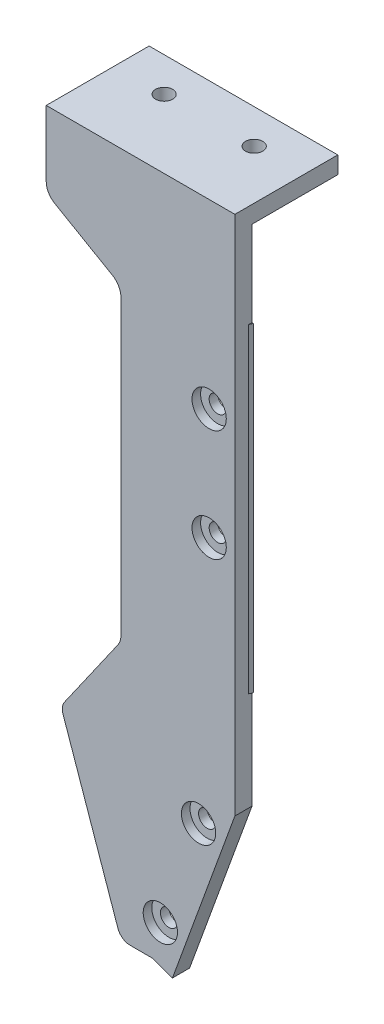
ISO-10303-21;
HEADER;
FILE_DESCRIPTION(('STEP AP214'),'2;1');
FILE_NAME('part.step','',(''),(''),'','','');
FILE_SCHEMA(('AUTOMOTIVE_DESIGN { 1 0 10303 214 1 1 1 1 }'));
ENDSEC;
DATA;
#1=APPLICATION_CONTEXT('core data for automotive mechanical design processes');
#2=APPLICATION_PROTOCOL_DEFINITION('international standard','automotive_design',2000,#1);
#3=PRODUCT_CONTEXT('',#1,'mechanical');
#4=PRODUCT('Part','Part','',(#3));
#5=PRODUCT_RELATED_PRODUCT_CATEGORY('part','',(#4));
#6=PRODUCT_DEFINITION_FORMATION('','',#4);
#7=PRODUCT_DEFINITION_CONTEXT('part definition',#1,'design');
#8=PRODUCT_DEFINITION('design','',#6,#7);
#9=PRODUCT_DEFINITION_SHAPE('','',#8);
#10=(LENGTH_UNIT() NAMED_UNIT(*) SI_UNIT(.MILLI.,.METRE.));
#11=(NAMED_UNIT(*) PLANE_ANGLE_UNIT() SI_UNIT($,.RADIAN.));
#12=(NAMED_UNIT(*) SI_UNIT($,.STERADIAN.) SOLID_ANGLE_UNIT());
#13=UNCERTAINTY_MEASURE_WITH_UNIT(LENGTH_MEASURE(1.E-05),#10,'distance_accuracy_value','');
#14=(GEOMETRIC_REPRESENTATION_CONTEXT(3) GLOBAL_UNCERTAINTY_ASSIGNED_CONTEXT((#13)) GLOBAL_UNIT_ASSIGNED_CONTEXT((#10,
#11,#12)) REPRESENTATION_CONTEXT('',''));
#15=CARTESIAN_POINT('',(0.,0.,0.));
#16=DIRECTION('',(0.,0.,1.));
#17=DIRECTION('',(1.,0.,0.));
#18=AXIS2_PLACEMENT_3D('',#15,#16,#17);
#19=CARTESIAN_POINT('',(91.0567161561715,-93.9915403547906,27.5));
#20=DIRECTION('',(0.,0.,-1.));
#21=DIRECTION('',(-1.,0.,0.));
#22=AXIS2_PLACEMENT_3D('',#19,#20,#21);
#23=CYLINDRICAL_SURFACE('',#22,0.999999999999998);
#24=CARTESIAN_POINT('',(91.0567161561715,-93.9915403547906,21.5));
#25=DIRECTION('',(0.,0.,-1.));
#26=DIRECTION('',(-1.,0.,0.));
#27=AXIS2_PLACEMENT_3D('',#24,#25,#26);
#28=CIRCLE('',#27,0.999999999999998);
#29=CARTESIAN_POINT('',(90.0567161561715,-93.9915403547906,21.5));
#30=VERTEX_POINT('',#29);
#31=EDGE_CURVE('E340',#30,#30,#28,.T.);
#32=ORIENTED_EDGE('',*,*,#31,.T.);
#33=EDGE_LOOP('',(#32));
#34=FACE_BOUND('',#33,.T.);
#35=CARTESIAN_POINT('',(91.0567161561715,-93.9915403547906,22.5));
#36=DIRECTION('',(0.,0.,1.));
#37=DIRECTION('',(1.,0.,0.));
#38=AXIS2_PLACEMENT_3D('',#35,#36,#37);
#39=CIRCLE('',#38,0.999999999999998);
#40=CARTESIAN_POINT('',(92.0567161561715,-93.9915403547906,22.5));
#41=VERTEX_POINT('',#40);
#42=EDGE_CURVE('E40',#41,#41,#39,.F.);
#43=ORIENTED_EDGE('',*,*,#42,.F.);
#44=EDGE_LOOP('',(#43));
#45=FACE_BOUND('',#44,.T.);
#46=ADVANCED_FACE('F36',(#34,#45),#23,.F.);
#47=CARTESIAN_POINT('',(86.6001936886376,-106.235735203631,27.5));
#48=DIRECTION('',(0.,0.,-1.));
#49=DIRECTION('',(-1.,0.,0.));
#50=AXIS2_PLACEMENT_3D('',#47,#48,#49);
#51=CYLINDRICAL_SURFACE('',#50,0.999999999999998);
#52=CARTESIAN_POINT('',(86.6001936886376,-106.235735203631,21.5));
#53=DIRECTION('',(0.,0.,-1.));
#54=DIRECTION('',(-1.,0.,0.));
#55=AXIS2_PLACEMENT_3D('',#52,#53,#54);
#56=CIRCLE('',#55,0.999999999999998);
#57=CARTESIAN_POINT('',(85.6001936886376,-106.235735203631,21.5));
#58=VERTEX_POINT('',#57);
#59=EDGE_CURVE('E365',#58,#58,#56,.T.);
#60=ORIENTED_EDGE('',*,*,#59,.T.);
#61=EDGE_LOOP('',(#60));
#62=FACE_BOUND('',#61,.T.);
#63=CARTESIAN_POINT('',(86.6001936886376,-106.235735203631,22.5));
#64=DIRECTION('',(0.,0.,1.));
#65=DIRECTION('',(1.,0.,0.));
#66=AXIS2_PLACEMENT_3D('',#63,#64,#65);
#67=CIRCLE('',#66,0.999999999999998);
#68=CARTESIAN_POINT('',(87.6001936886376,-106.235735203631,22.5));
#69=VERTEX_POINT('',#68);
#70=EDGE_CURVE('E344',#69,#69,#67,.F.);
#71=ORIENTED_EDGE('',*,*,#70,.F.);
#72=EDGE_LOOP('',(#71));
#73=FACE_BOUND('',#72,.T.);
#74=ADVANCED_FACE('F426',(#62,#73),#51,.F.);
#75=CARTESIAN_POINT('',(92.2895532458189,-64.5135083268963,27.5));
#76=DIRECTION('',(0.,0.,-1.));
#77=DIRECTION('',(-1.,0.,0.));
#78=AXIS2_PLACEMENT_3D('',#75,#76,#77);
#79=CYLINDRICAL_SURFACE('',#78,0.999999999999998);
#80=CARTESIAN_POINT('',(92.2895532458189,-64.5135083268963,21.5));
#81=DIRECTION('',(0.,0.,-1.));
#82=DIRECTION('',(-1.,0.,0.));
#83=AXIS2_PLACEMENT_3D('',#80,#81,#82);
#84=CIRCLE('',#83,0.999999999999998);
#85=CARTESIAN_POINT('',(91.2895532458189,-64.5135083268963,21.5));
#86=VERTEX_POINT('',#85);
#87=EDGE_CURVE('E361',#86,#86,#84,.T.);
#88=ORIENTED_EDGE('',*,*,#87,.T.);
#89=EDGE_LOOP('',(#88));
#90=FACE_BOUND('',#89,.T.);
#91=CARTESIAN_POINT('',(92.2895532458189,-64.5135083268963,22.5));
#92=DIRECTION('',(0.,0.,1.));
#93=DIRECTION('',(1.,0.,0.));
#94=AXIS2_PLACEMENT_3D('',#91,#92,#93);
#95=CIRCLE('',#94,0.999999999999998);
#96=CARTESIAN_POINT('',(93.2895532458189,-64.5135083268963,22.5));
#97=VERTEX_POINT('',#96);
#98=EDGE_CURVE('E342',#97,#97,#95,.F.);
#99=ORIENTED_EDGE('',*,*,#98,.F.);
#100=EDGE_LOOP('',(#99));
#101=FACE_BOUND('',#100,.T.);
#102=ADVANCED_FACE('F432',(#90,#101),#79,.F.);
#103=CARTESIAN_POINT('',(92.2895532458189,-51.5135083268963,27.5));
#104=DIRECTION('',(0.,0.,-1.));
#105=DIRECTION('',(-1.,0.,0.));
#106=AXIS2_PLACEMENT_3D('',#103,#104,#105);
#107=CYLINDRICAL_SURFACE('',#106,0.999999999999998);
#108=CARTESIAN_POINT('',(92.2895532458189,-51.5135083268963,21.5));
#109=DIRECTION('',(0.,0.,-1.));
#110=DIRECTION('',(-1.,0.,0.));
#111=AXIS2_PLACEMENT_3D('',#108,#109,#110);
#112=CIRCLE('',#111,0.999999999999998);
#113=CARTESIAN_POINT('',(91.2895532458189,-51.5135083268963,21.5));
#114=VERTEX_POINT('',#113);
#115=EDGE_CURVE('E364',#114,#114,#112,.T.);
#116=ORIENTED_EDGE('',*,*,#115,.T.);
#117=EDGE_LOOP('',(#116));
#118=FACE_BOUND('',#117,.T.);
#119=CARTESIAN_POINT('',(92.2895532458189,-51.5135083268963,22.5));
#120=DIRECTION('',(0.,0.,1.));
#121=DIRECTION('',(1.,0.,0.));
#122=AXIS2_PLACEMENT_3D('',#119,#120,#121);
#123=CIRCLE('',#122,0.999999999999998);
#124=CARTESIAN_POINT('',(93.2895532458189,-51.5135083268963,22.5));
#125=VERTEX_POINT('',#124);
#126=EDGE_CURVE('E337',#125,#125,#123,.F.);
#127=ORIENTED_EDGE('',*,*,#126,.F.);
#128=EDGE_LOOP('',(#127));
#129=FACE_BOUND('',#128,.T.);
#130=ADVANCED_FACE('F438',(#118,#129),#107,.F.);
#131=CARTESIAN_POINT('',(70.,-110.3,21.5));
#132=DIRECTION('',(0.,0.,1.));
#133=DIRECTION('',(0.,-1.,0.));
#134=AXIS2_PLACEMENT_3D('',#131,#132,#133);
#135=PLANE('',#134);
#136=ORIENTED_EDGE('',*,*,#87,.F.);
#137=EDGE_LOOP('',(#136));
#138=FACE_BOUND('',#137,.T.);
#139=ORIENTED_EDGE('',*,*,#59,.F.);
#140=EDGE_LOOP('',(#139));
#141=FACE_BOUND('',#140,.T.);
#142=ORIENTED_EDGE('',*,*,#31,.F.);
#143=EDGE_LOOP('',(#142));
#144=FACE_BOUND('',#143,.T.);
#145=ORIENTED_EDGE('',*,*,#115,.F.);
#146=EDGE_LOOP('',(#145));
#147=FACE_BOUND('',#146,.T.);
#148=DIRECTION('',(-1.,0.,0.));
#149=VECTOR('',#148,1.);
#150=CARTESIAN_POINT('',(73.2895532458189,-32.3635083268963,21.5));
#151=LINE('',#150,#149);
#152=CARTESIAN_POINT('',(95.2895532458189,-32.3635083268963,21.5));
#153=VERTEX_POINT('',#152);
#154=CARTESIAN_POINT('',(73.2895532458189,-32.3635083268963,21.5));
#155=VERTEX_POINT('',#154);
#156=EDGE_CURVE('E53',#153,#155,#151,.T.);
#157=ORIENTED_EDGE('',*,*,#156,.F.);
#158=DIRECTION('',(0.,1.,0.));
#159=VECTOR('',#158,1.);
#160=CARTESIAN_POINT('',(95.2895532458189,0.,21.5));
#161=LINE('',#160,#159);
#162=CARTESIAN_POINT('',(95.2895532458189,-42.3,21.5));
#163=VERTEX_POINT('',#162);
#164=EDGE_CURVE('E196',#163,#153,#161,.T.);
#165=ORIENTED_EDGE('',*,*,#164,.F.);
#166=DIRECTION('',(1.,0.,0.));
#167=VECTOR('',#166,1.);
#168=CARTESIAN_POINT('',(94.75,-42.3,21.5));
#169=LINE('',#168,#167);
#170=CARTESIAN_POINT('',(95.4364916731037,-42.3,21.5));
#171=VERTEX_POINT('',#170);
#172=EDGE_CURVE('E263',#163,#171,#169,.T.);
#173=ORIENTED_EDGE('',*,*,#172,.T.);
#174=DIRECTION('',(0.,-1.,0.));
#175=VECTOR('',#174,1.);
#176=CARTESIAN_POINT('',(95.4364916731037,-42.3,21.5));
#177=LINE('',#176,#175);
#178=CARTESIAN_POINT('',(95.4364916731037,-79.5997924618132,21.5));
#179=VERTEX_POINT('',#178);
#180=EDGE_CURVE('E265',#171,#179,#177,.T.);
#181=ORIENTED_EDGE('',*,*,#180,.T.);
#182=DIRECTION('',(1.,0.,0.));
#183=VECTOR('',#182,1.);
#184=CARTESIAN_POINT('',(94.38388347648,-79.59979246179,21.5));
#185=LINE('',#184,#183);
#186=CARTESIAN_POINT('',(95.2895532458189,-79.5997924618016,21.5));
#187=VERTEX_POINT('',#186);
#188=EDGE_CURVE('E268',#187,#179,#185,.T.);
#189=ORIENTED_EDGE('',*,*,#188,.F.);
#190=CARTESIAN_POINT('',(95.2895532458189,-91.1333292312439,21.5));
#191=VERTEX_POINT('',#190);
#192=EDGE_CURVE('E209',#191,#187,#161,.T.);
#193=ORIENTED_EDGE('',*,*,#192,.F.);
#194=DIRECTION('',(-0.342020143325699,-0.939692620785897,0.));
#195=VECTOR('',#194,1.);
#196=CARTESIAN_POINT('',(95.2895532458189,-91.1333292312439,21.5));
#197=LINE('',#196,#195);
#198=CARTESIAN_POINT('',(88.0101485604946,-111.133329231243,21.5));
#199=VERTEX_POINT('',#198);
#200=EDGE_CURVE('E260',#191,#199,#197,.T.);
#201=ORIENTED_EDGE('',*,*,#200,.T.);
#202=DIRECTION('',(-0.939692620785897,0.342020143325699,0.));
#203=VECTOR('',#202,1.);
#204=CARTESIAN_POINT('',(86.190441625069,-110.47101007166,21.5));
#205=LINE('',#204,#203);
#206=CARTESIAN_POINT('',(85.720595314676,-110.3,21.5));
#207=VERTEX_POINT('',#206);
#208=EDGE_CURVE('E271',#199,#207,#205,.T.);
#209=ORIENTED_EDGE('',*,*,#208,.T.);
#210=DIRECTION('',(1.,0.,0.));
#211=VECTOR('',#210,1.);
#212=CARTESIAN_POINT('',(83.066681965713,-110.3,21.5));
#213=LINE('',#212,#211);
#214=CARTESIAN_POINT('',(83.066681965713,-110.3,21.5));
#215=VERTEX_POINT('',#214);
#216=EDGE_CURVE('E276',#215,#207,#213,.T.);
#217=ORIENTED_EDGE('',*,*,#216,.F.);
#218=CARTESIAN_POINT('',(83.066681965713,-108.8,21.5));
#219=DIRECTION('',(0.,0.,-1.));
#220=DIRECTION('',(0.,-1.,0.));
#221=AXIS2_PLACEMENT_3D('',#218,#219,#220);
#222=CIRCLE('',#221,1.5);
#223=CARTESIAN_POINT('',(81.6498173079181,-109.29243734778,21.5));
#224=VERTEX_POINT('',#223);
#225=EDGE_CURVE('E275',#215,#224,#222,.T.);
#226=ORIENTED_EDGE('',*,*,#225,.T.);
#227=DIRECTION('',(-0.328291565188003,0.944576438530208,0.));
#228=VECTOR('',#227,1.);
#229=CARTESIAN_POINT('',(81.6498173079181,-109.29243734778,21.5));
#230=LINE('',#229,#228);
#231=CARTESIAN_POINT('',(75.251803773117,-90.88376201398,21.5));
#232=VERTEX_POINT('',#231);
#233=EDGE_CURVE('E281',#224,#232,#230,.T.);
#234=ORIENTED_EDGE('',*,*,#233,.T.);
#235=CARTESIAN_POINT('',(76.668668430912,-90.3913246662,21.5));
#236=DIRECTION('',(0.,0.,-1.));
#237=DIRECTION('',(-0.944576438530206,-0.328291565188007,0.));
#238=AXIS2_PLACEMENT_3D('',#235,#236,#237);
#239=CIRCLE('',#238,1.5);
#240=CARTESIAN_POINT('',(75.439940364479,-89.5309600116699,21.5));
#241=VERTEX_POINT('',#240);
#242=EDGE_CURVE('E284',#232,#241,#239,.T.);
#243=ORIENTED_EDGE('',*,*,#242,.T.);
#244=DIRECTION('',(0.573576436351011,0.819152044289016,0.));
#245=VECTOR('',#244,1.);
#246=CARTESIAN_POINT('',(75.439940364479,-89.5309600116699,21.5));
#247=LINE('',#246,#245);
#248=CARTESIAN_POINT('',(81.638304088578,-80.67877921404,21.5));
#249=VERTEX_POINT('',#248);
#250=EDGE_CURVE('E287',#241,#249,#247,.T.);
#251=ORIENTED_EDGE('',*,*,#250,.T.);
#252=CARTESIAN_POINT('',(80.,-79.5316263413399,21.5));
#253=DIRECTION('',(0.,0.,1.));
#254=DIRECTION('',(0.81915204428897,-0.573576436351077,0.));
#255=AXIS2_PLACEMENT_3D('',#252,#253,#254);
#256=CIRCLE('',#255,2.);
#257=CARTESIAN_POINT('',(82.,-79.5316263413399,21.5));
#258=VERTEX_POINT('',#257);
#259=EDGE_CURVE('E290',#249,#258,#256,.T.);
#260=ORIENTED_EDGE('',*,*,#259,.T.);
#261=DIRECTION('',(0.,1.,0.));
#262=VECTOR('',#261,1.);
#263=CARTESIAN_POINT('',(82.,-79.5316263413399,21.5));
#264=LINE('',#263,#262);
#265=CARTESIAN_POINT('',(82.,-45.38290376865,21.5));
#266=VERTEX_POINT('',#265);
#267=EDGE_CURVE('E293',#258,#266,#264,.T.);
#268=ORIENTED_EDGE('',*,*,#267,.T.);
#269=CARTESIAN_POINT('',(80.,-45.38290376865,21.5));
#270=DIRECTION('',(0.,0.,1.));
#271=DIRECTION('',(1.,0.,0.));
#272=AXIS2_PLACEMENT_3D('',#269,#270,#271);
#273=CIRCLE('',#272,2.);
#274=CARTESIAN_POINT('',(81.,-43.65085296109,21.5));
#275=VERTEX_POINT('',#274);
#276=EDGE_CURVE('E296',#266,#275,#273,.T.);
#277=ORIENTED_EDGE('',*,*,#276,.T.);
#278=DIRECTION('',(-0.866025403784429,0.500000000000017,0.));
#279=VECTOR('',#278,1.);
#280=CARTESIAN_POINT('',(81.,-43.65085296109,21.5));
#281=LINE('',#280,#279);
#282=CARTESIAN_POINT('',(74.2895532458181,-39.7765747211803,21.5));
#283=VERTEX_POINT('',#282);
#284=EDGE_CURVE('E299',#275,#283,#281,.T.);
#285=ORIENTED_EDGE('',*,*,#284,.T.);
#286=CARTESIAN_POINT('',(75.2895532458189,-38.0445239136101,21.5));
#287=DIRECTION('',(0.,0.,1.));
#288=DIRECTION('',(1.,0.,0.));
#289=AXIS2_PLACEMENT_3D('',#286,#287,#288);
#290=CIRCLE('',#289,2.);
#291=CARTESIAN_POINT('',(73.2895532458189,-38.0445239136101,21.5));
#292=VERTEX_POINT('',#291);
#293=EDGE_CURVE('E333',#283,#292,#290,.F.);
#294=ORIENTED_EDGE('',*,*,#293,.T.);
#295=DIRECTION('',(0.,-1.,0.));
#296=VECTOR('',#295,1.);
#297=CARTESIAN_POINT('',(73.2895532458189,0.,21.5));
#298=LINE('',#297,#296);
#299=EDGE_CURVE('E197',#155,#292,#298,.T.);
#300=ORIENTED_EDGE('',*,*,#299,.F.);
#301=EDGE_LOOP('',(#157,#165,#173,#181,#189,#193,#201,#209,#217,#226,#234,#243,#251,#260,#268,
#277,#285,#294,#300));
#302=FACE_BOUND('',#301,.T.);
#303=ADVANCED_FACE('F401',(#138,#141,#144,#147,#302),#135,.F.);
#304=CARTESIAN_POINT('',(93.5,-42.3,21.));
#305=DIRECTION('',(0.,-1.,0.));
#306=DIRECTION('',(-1.,0.,0.));
#307=AXIS2_PLACEMENT_3D('',#304,#305,#306);
#308=CYLINDRICAL_SURFACE('',#307,2.);
#309=CARTESIAN_POINT('',(93.5,-42.3,21.));
#310=DIRECTION('',(0.,-1.,0.));
#311=DIRECTION('',(1.,0.,0.));
#312=AXIS2_PLACEMENT_3D('',#309,#310,#311);
#313=CIRCLE('',#312,2.);
#314=CARTESIAN_POINT('',(95.2895532458189,-42.3,21.8930280960748));
#315=VERTEX_POINT('',#314);
#316=EDGE_CURVE('E323',#171,#315,#313,.T.);
#317=ORIENTED_EDGE('',*,*,#316,.T.);
#318=DIRECTION('',(0.,-1.,0.));
#319=VECTOR('',#318,1.);
#320=CARTESIAN_POINT('',(95.2895532458189,-42.3,21.8930280960748));
#321=LINE('',#320,#319);
#322=CARTESIAN_POINT('',(95.2895532458189,-79.5997924618132,21.8930280960748));
#323=VERTEX_POINT('',#322);
#324=EDGE_CURVE('E255',#315,#323,#321,.T.);
#325=ORIENTED_EDGE('',*,*,#324,.T.);
#326=CARTESIAN_POINT('',(93.5,-79.59979246179,21.));
#327=DIRECTION('',(0.,-1.,0.));
#328=DIRECTION('',(1.,0.,0.));
#329=AXIS2_PLACEMENT_3D('',#326,#327,#328);
#330=CIRCLE('',#329,2.);
#331=EDGE_CURVE('E274',#179,#323,#330,.T.);
#332=ORIENTED_EDGE('',*,*,#331,.F.);
#333=ORIENTED_EDGE('',*,*,#180,.F.);
#334=EDGE_LOOP('',(#317,#325,#332,#333));
#335=FACE_BOUND('',#334,.T.);
#336=ADVANCED_FACE('F408',(#335),#308,.T.);
#337=CARTESIAN_POINT('',(94.38388347648,-79.59979246179,21.88388347648));
#338=DIRECTION('',(0.,1.,0.));
#339=DIRECTION('',(0.,0.,-1.));
#340=AXIS2_PLACEMENT_3D('',#337,#338,#339);
#341=PLANE('',#340);
#342=DIRECTION('',(0.,0.,1.));
#343=VECTOR('',#342,1.);
#344=CARTESIAN_POINT('',(95.2895532458189,-79.59979246179,21.88388347648));
#345=LINE('',#344,#343);
#346=EDGE_CURVE('E258',#187,#323,#345,.T.);
#347=ORIENTED_EDGE('',*,*,#346,.F.);
#348=ORIENTED_EDGE('',*,*,#188,.T.);
#349=ORIENTED_EDGE('',*,*,#331,.T.);
#350=EDGE_LOOP('',(#347,#348,#349));
#351=FACE_BOUND('',#350,.T.);
#352=ADVANCED_FACE('F404',(#351),#341,.F.);
#353=CARTESIAN_POINT('',(94.75,-42.3,18.));
#354=DIRECTION('',(0.,1.,0.));
#355=DIRECTION('',(0.,0.,-1.));
#356=AXIS2_PLACEMENT_3D('',#353,#354,#355);
#357=PLANE('',#356);
#358=ORIENTED_EDGE('',*,*,#172,.F.);
#359=DIRECTION('',(0.,0.,1.));
#360=VECTOR('',#359,1.);
#361=CARTESIAN_POINT('',(95.2895532458189,-42.3,18.));
#362=LINE('',#361,#360);
#363=EDGE_CURVE('E248',#163,#315,#362,.T.);
#364=ORIENTED_EDGE('',*,*,#363,.T.);
#365=ORIENTED_EDGE('',*,*,#316,.F.);
#366=EDGE_LOOP('',(#358,#364,#365));
#367=FACE_BOUND('',#366,.T.);
#368=ADVANCED_FACE('F412',(#367),#357,.T.);
#369=CARTESIAN_POINT('',(76.,-40.76410161514,22.25));
#370=DIRECTION('',(0.500000000000017,0.866025403784429,0.));
#371=DIRECTION('',(0.866025403784429,-0.500000000000017,0.));
#372=AXIS2_PLACEMENT_3D('',#369,#370,#371);
#373=PLANE('',#372);
#374=DIRECTION('',(-0.866025403784429,0.500000000000017,0.));
#375=VECTOR('',#374,1.);
#376=CARTESIAN_POINT('',(1.34862621941938,2.3358891324538,23.5));
#377=LINE('',#376,#375);
#378=CARTESIAN_POINT('',(81.,-43.65085296109,23.5));
#379=VERTEX_POINT('',#378);
#380=CARTESIAN_POINT('',(74.2895532458182,-39.7765747211803,23.5));
#381=VERTEX_POINT('',#380);
#382=EDGE_CURVE('E239',#379,#381,#377,.T.);
#383=ORIENTED_EDGE('',*,*,#382,.T.);
#384=DIRECTION('',(0.,0.,-1.));
#385=VECTOR('',#384,1.);
#386=CARTESIAN_POINT('',(74.2895532458189,-39.776574721179,22.25));
#387=LINE('',#386,#385);
#388=EDGE_CURVE('E330',#381,#283,#387,.T.);
#389=ORIENTED_EDGE('',*,*,#388,.T.);
#390=ORIENTED_EDGE('',*,*,#284,.F.);
#391=DIRECTION('',(0.,0.,-1.));
#392=VECTOR('',#391,1.);
#393=CARTESIAN_POINT('',(81.,-43.65085296109,23.));
#394=LINE('',#393,#392);
#395=EDGE_CURVE('E302',#379,#275,#394,.T.);
#396=ORIENTED_EDGE('',*,*,#395,.F.);
#397=EDGE_LOOP('',(#383,#389,#390,#396));
#398=FACE_BOUND('',#397,.T.);
#399=ADVANCED_FACE('F414',(#398),#373,.F.);
#400=CARTESIAN_POINT('',(80.,-45.38290376865,69.9296));
#401=DIRECTION('',(0.,0.,-1.));
#402=DIRECTION('',(-0.500000000000015,-0.86602540378443,0.));
#403=AXIS2_PLACEMENT_3D('',#400,#401,#402);
#404=CYLINDRICAL_SURFACE('',#403,2.);
#405=ORIENTED_EDGE('',*,*,#276,.F.);
#406=DIRECTION('',(0.,0.,-1.));
#407=VECTOR('',#406,1.);
#408=CARTESIAN_POINT('',(82.,-45.38290376865,23.));
#409=LINE('',#408,#407);
#410=CARTESIAN_POINT('',(82.,-45.38290376865,23.5));
#411=VERTEX_POINT('',#410);
#412=EDGE_CURVE('E305',#411,#266,#409,.T.);
#413=ORIENTED_EDGE('',*,*,#412,.F.);
#414=CARTESIAN_POINT('',(80.,-45.38290376865,23.5));
#415=DIRECTION('',(0.,0.,-1.));
#416=DIRECTION('',(-1.,0.,0.));
#417=AXIS2_PLACEMENT_3D('',#414,#415,#416);
#418=CIRCLE('',#417,2.);
#419=EDGE_CURVE('E236',#411,#379,#418,.F.);
#420=ORIENTED_EDGE('',*,*,#419,.T.);
#421=ORIENTED_EDGE('',*,*,#395,.T.);
#422=EDGE_LOOP('',(#405,#413,#420,#421));
#423=FACE_BOUND('',#422,.T.);
#424=ADVANCED_FACE('F420',(#423),#404,.F.);
#425=CARTESIAN_POINT('',(82.,-62.19521357469,22.25));
#426=DIRECTION('',(1.,0.,0.));
#427=DIRECTION('',(0.,-1.,0.));
#428=AXIS2_PLACEMENT_3D('',#425,#426,#427);
#429=PLANE('',#428);
#430=DIRECTION('',(0.,0.,-1.));
#431=VECTOR('',#430,1.);
#432=CARTESIAN_POINT('',(82.,-79.5316263413399,23.));
#433=LINE('',#432,#431);
#434=CARTESIAN_POINT('',(82.,-79.5316263413399,23.5));
#435=VERTEX_POINT('',#434);
#436=EDGE_CURVE('E308',#435,#258,#433,.T.);
#437=ORIENTED_EDGE('',*,*,#436,.F.);
#438=DIRECTION('',(0.,1.,0.));
#439=VECTOR('',#438,1.);
#440=CARTESIAN_POINT('',(82.,0.,23.5));
#441=LINE('',#440,#439);
#442=EDGE_CURVE('E233',#435,#411,#441,.T.);
#443=ORIENTED_EDGE('',*,*,#442,.T.);
#444=ORIENTED_EDGE('',*,*,#412,.T.);
#445=ORIENTED_EDGE('',*,*,#267,.F.);
#446=EDGE_LOOP('',(#437,#443,#444,#445));
#447=FACE_BOUND('',#446,.T.);
#448=ADVANCED_FACE('F773',(#447),#429,.F.);
#449=CARTESIAN_POINT('',(80.,-79.5316263413399,69.9296));
#450=DIRECTION('',(0.,0.,-1.));
#451=DIRECTION('',(-1.,0.,0.));
#452=AXIS2_PLACEMENT_3D('',#449,#450,#451);
#453=CYLINDRICAL_SURFACE('',#452,2.);
#454=ORIENTED_EDGE('',*,*,#259,.F.);
#455=DIRECTION('',(0.,0.,-1.));
#456=VECTOR('',#455,1.);
#457=CARTESIAN_POINT('',(81.638304088578,-80.67877921404,23.));
#458=LINE('',#457,#456);
#459=CARTESIAN_POINT('',(81.6383040885789,-80.6787792140407,23.5));
#460=VERTEX_POINT('',#459);
#461=EDGE_CURVE('E312',#460,#249,#458,.T.);
#462=ORIENTED_EDGE('',*,*,#461,.F.);
#463=CARTESIAN_POINT('',(80.,-79.5316263413399,23.5));
#464=DIRECTION('',(0.,0.,-1.));
#465=DIRECTION('',(-1.,0.,0.));
#466=AXIS2_PLACEMENT_3D('',#463,#464,#465);
#467=CIRCLE('',#466,2.);
#468=EDGE_CURVE('E230',#460,#435,#467,.F.);
#469=ORIENTED_EDGE('',*,*,#468,.T.);
#470=ORIENTED_EDGE('',*,*,#436,.T.);
#471=EDGE_LOOP('',(#454,#462,#469,#470));
#472=FACE_BOUND('',#471,.T.);
#473=ADVANCED_FACE('F762',(#472),#453,.F.);
#474=CARTESIAN_POINT('',(76.,-88.7311119595499,22.25));
#475=DIRECTION('',(0.819152044289016,-0.573576436351011,0.));
#476=DIRECTION('',(-0.573576436351011,-0.819152044289016,0.));
#477=AXIS2_PLACEMENT_3D('',#474,#475,#476);
#478=PLANE('',#477);
#479=ORIENTED_EDGE('',*,*,#250,.F.);
#480=DIRECTION('',(0.,0.,1.));
#481=VECTOR('',#480,1.);
#482=CARTESIAN_POINT('',(75.439940364479,-89.5309600116699,21.5));
#483=LINE('',#482,#481);
#484=CARTESIAN_POINT('',(75.439940364479,-89.5309600116699,23.5));
#485=VERTEX_POINT('',#484);
#486=EDGE_CURVE('E311',#241,#485,#483,.T.);
#487=ORIENTED_EDGE('',*,*,#486,.T.);
#488=DIRECTION('',(0.573576436351011,0.819152044289016,0.));
#489=VECTOR('',#488,1.);
#490=CARTESIAN_POINT('',(92.6867510176329,-64.8999617547072,23.5));
#491=LINE('',#490,#489);
#492=EDGE_CURVE('E227',#485,#460,#491,.T.);
#493=ORIENTED_EDGE('',*,*,#492,.T.);
#494=ORIENTED_EDGE('',*,*,#461,.T.);
#495=EDGE_LOOP('',(#479,#487,#493,#494));
#496=FACE_BOUND('',#495,.T.);
#497=ADVANCED_FACE('F751',(#496),#478,.F.);
#498=CARTESIAN_POINT('',(76.668668430912,-90.3913246662,-59.9296));
#499=DIRECTION('',(0.,0.,1.));
#500=DIRECTION('',(0.819152044289016,-0.573576436351012,0.));
#501=AXIS2_PLACEMENT_3D('',#498,#499,#500);
#502=CYLINDRICAL_SURFACE('',#501,1.5);
#503=ORIENTED_EDGE('',*,*,#486,.F.);
#504=ORIENTED_EDGE('',*,*,#242,.F.);
#505=DIRECTION('',(0.,0.,1.));
#506=VECTOR('',#505,1.);
#507=CARTESIAN_POINT('',(75.251803773117,-90.88376201398,21.5));
#508=LINE('',#507,#506);
#509=CARTESIAN_POINT('',(75.2518037731161,-90.8837620139803,23.5));
#510=VERTEX_POINT('',#509);
#511=EDGE_CURVE('E315',#232,#510,#508,.T.);
#512=ORIENTED_EDGE('',*,*,#511,.T.);
#513=CARTESIAN_POINT('',(76.668668430912,-90.3913246662,23.5));
#514=DIRECTION('',(0.,0.,-1.));
#515=DIRECTION('',(-1.,0.,0.));
#516=AXIS2_PLACEMENT_3D('',#513,#514,#515);
#517=CIRCLE('',#516,1.5);
#518=EDGE_CURVE('E224',#510,#485,#517,.T.);
#519=ORIENTED_EDGE('',*,*,#518,.T.);
#520=EDGE_LOOP('',(#503,#504,#512,#519));
#521=FACE_BOUND('',#520,.T.);
#522=ADVANCED_FACE('F740',(#521),#502,.T.);
#523=CARTESIAN_POINT('',(78.5,-100.22962998314,22.25));
#524=DIRECTION('',(0.944576438530208,0.328291565188003,0.));
#525=DIRECTION('',(0.328291565188003,-0.944576438530208,0.));
#526=AXIS2_PLACEMENT_3D('',#523,#524,#525);
#527=PLANE('',#526);
#528=ORIENTED_EDGE('',*,*,#233,.F.);
#529=DIRECTION('',(0.,0.,1.));
#530=VECTOR('',#529,1.);
#531=CARTESIAN_POINT('',(81.6498173079181,-109.29243734778,21.5));
#532=LINE('',#531,#530);
#533=CARTESIAN_POINT('',(81.6498173079181,-109.29243734778,23.5));
#534=VERTEX_POINT('',#533);
#535=EDGE_CURVE('E318',#224,#534,#532,.T.);
#536=ORIENTED_EDGE('',*,*,#535,.T.);
#537=DIRECTION('',(-0.328291565188003,0.944576438530208,0.));
#538=VECTOR('',#537,1.);
#539=CARTESIAN_POINT('',(38.9587796924058,13.5402898498463,23.5));
#540=LINE('',#539,#538);
#541=EDGE_CURVE('E221',#534,#510,#540,.T.);
#542=ORIENTED_EDGE('',*,*,#541,.T.);
#543=ORIENTED_EDGE('',*,*,#511,.F.);
#544=EDGE_LOOP('',(#528,#536,#542,#543));
#545=FACE_BOUND('',#544,.T.);
#546=ADVANCED_FACE('F729',(#545),#527,.F.);
#547=CARTESIAN_POINT('',(83.066681965713,-108.8,-59.9296));
#548=DIRECTION('',(0.,0.,1.));
#549=DIRECTION('',(0.944576438530206,0.328291565188007,0.));
#550=AXIS2_PLACEMENT_3D('',#547,#548,#549);
#551=CYLINDRICAL_SURFACE('',#550,1.5);
#552=ORIENTED_EDGE('',*,*,#535,.F.);
#553=ORIENTED_EDGE('',*,*,#225,.F.);
#554=DIRECTION('',(0.,0.,1.));
#555=VECTOR('',#554,1.);
#556=CARTESIAN_POINT('',(83.066681965713,-110.3,21.5));
#557=LINE('',#556,#555);
#558=CARTESIAN_POINT('',(83.066681965713,-110.3,23.5));
#559=VERTEX_POINT('',#558);
#560=EDGE_CURVE('E278',#215,#559,#557,.T.);
#561=ORIENTED_EDGE('',*,*,#560,.T.);
#562=CARTESIAN_POINT('',(83.066681965713,-108.8,23.5));
#563=DIRECTION('',(0.,0.,-1.));
#564=DIRECTION('',(-1.,0.,0.));
#565=AXIS2_PLACEMENT_3D('',#562,#563,#564);
#566=CIRCLE('',#565,1.5);
#567=EDGE_CURVE('E218',#559,#534,#566,.T.);
#568=ORIENTED_EDGE('',*,*,#567,.T.);
#569=EDGE_LOOP('',(#552,#553,#561,#568));
#570=FACE_BOUND('',#569,.T.);
#571=ADVANCED_FACE('F718',(#570),#551,.T.);
#572=CARTESIAN_POINT('',(81.5,-110.3,22.25));
#573=DIRECTION('',(0.,-1.,0.));
#574=DIRECTION('',(-1.,0.,0.));
#575=AXIS2_PLACEMENT_3D('',#572,#573,#574);
#576=PLANE('',#575);
#577=ORIENTED_EDGE('',*,*,#216,.T.);
#578=DIRECTION('',(0.,0.,-1.));
#579=VECTOR('',#578,1.);
#580=CARTESIAN_POINT('',(85.720595314676,-110.3,23.));
#581=LINE('',#580,#579);
#582=CARTESIAN_POINT('',(85.720595314676,-110.3,23.5));
#583=VERTEX_POINT('',#582);
#584=EDGE_CURVE('E270',#583,#207,#581,.T.);
#585=ORIENTED_EDGE('',*,*,#584,.F.);
#586=DIRECTION('',(-1.,0.,0.));
#587=VECTOR('',#586,1.);
#588=CARTESIAN_POINT('',(-1.77186336060973E-12,-110.299999999999,23.5));
#589=LINE('',#588,#587);
#590=EDGE_CURVE('E215',#583,#559,#589,.T.);
#591=ORIENTED_EDGE('',*,*,#590,.T.);
#592=ORIENTED_EDGE('',*,*,#560,.F.);
#593=EDGE_LOOP('',(#577,#585,#591,#592));
#594=FACE_BOUND('',#593,.T.);
#595=ADVANCED_FACE('F708',(#594),#576,.T.);
#596=CARTESIAN_POINT('',(86.190441625069,-110.47101007166,22.25));
#597=DIRECTION('',(-0.342020143325699,-0.939692620785897,0.));
#598=DIRECTION('',(-0.939692620785897,0.342020143325699,0.));
#599=AXIS2_PLACEMENT_3D('',#596,#597,#598);
#600=PLANE('',#599);
#601=ORIENTED_EDGE('',*,*,#208,.F.);
#602=DIRECTION('',(0.,0.,-1.));
#603=VECTOR('',#602,1.);
#604=CARTESIAN_POINT('',(88.0101485604946,-111.133329231243,23.5));
#605=LINE('',#604,#603);
#606=CARTESIAN_POINT('',(88.0101485604946,-111.133329231243,23.5));
#607=VERTEX_POINT('',#606);
#608=EDGE_CURVE('E249',#607,#199,#605,.T.);
#609=ORIENTED_EDGE('',*,*,#608,.F.);
#610=DIRECTION('',(-0.939692620785897,0.342020143325699,0.));
#611=VECTOR('',#610,1.);
#612=CARTESIAN_POINT('',(-25.4223318677038,-69.8472827563908,23.5));
#613=LINE('',#612,#611);
#614=EDGE_CURVE('E212',#607,#583,#613,.T.);
#615=ORIENTED_EDGE('',*,*,#614,.T.);
#616=ORIENTED_EDGE('',*,*,#584,.T.);
#617=EDGE_LOOP('',(#601,#609,#615,#616));
#618=FACE_BOUND('',#617,.T.);
#619=ADVANCED_FACE('F468',(#618),#600,.T.);
#620=CARTESIAN_POINT('',(95.2895532458189,0.,23.5));
#621=DIRECTION('',(-1.,0.,0.));
#622=DIRECTION('',(0.,0.,1.));
#623=AXIS2_PLACEMENT_3D('',#620,#621,#622);
#624=PLANE('',#623);
#625=ORIENTED_EDGE('',*,*,#192,.T.);
#626=ORIENTED_EDGE('',*,*,#346,.T.);
#627=ORIENTED_EDGE('',*,*,#324,.F.);
#628=ORIENTED_EDGE('',*,*,#363,.F.);
#629=ORIENTED_EDGE('',*,*,#164,.T.);
#630=DIRECTION('',(0.,0.,1.));
#631=VECTOR('',#630,1.);
#632=CARTESIAN_POINT('',(95.2895532458189,-32.3635083268963,11.5));
#633=LINE('',#632,#631);
#634=CARTESIAN_POINT('',(95.2895532458189,-32.3635083268963,11.5));
#635=VERTEX_POINT('',#634);
#636=EDGE_CURVE('E178',#635,#153,#633,.T.);
#637=ORIENTED_EDGE('',*,*,#636,.F.);
#638=DIRECTION('',(0.,-1.,0.));
#639=VECTOR('',#638,1.);
#640=CARTESIAN_POINT('',(95.2895532458189,-32.3635083268963,11.5));
#641=LINE('',#640,#639);
#642=CARTESIAN_POINT('',(95.2895532458189,-30.3635083268963,11.5));
#643=VERTEX_POINT('',#642);
#644=EDGE_CURVE('E185',#643,#635,#641,.T.);
#645=ORIENTED_EDGE('',*,*,#644,.F.);
#646=DIRECTION('',(0.,0.,-1.));
#647=VECTOR('',#646,1.);
#648=CARTESIAN_POINT('',(95.2895532458189,-30.3635083268963,23.5));
#649=LINE('',#648,#647);
#650=CARTESIAN_POINT('',(95.2895532458189,-30.3635083268963,23.5));
#651=VERTEX_POINT('',#650);
#652=EDGE_CURVE('E246',#651,#643,#649,.T.);
#653=ORIENTED_EDGE('',*,*,#652,.F.);
#654=DIRECTION('',(0.,1.,0.));
#655=VECTOR('',#654,1.);
#656=CARTESIAN_POINT('',(95.2895532458189,0.,23.5));
#657=LINE('',#656,#655);
#658=CARTESIAN_POINT('',(95.2895532458189,-91.1333292312439,23.5));
#659=VERTEX_POINT('',#658);
#660=EDGE_CURVE('E205',#659,#651,#657,.T.);
#661=ORIENTED_EDGE('',*,*,#660,.F.);
#662=DIRECTION('',(0.,0.,-1.));
#663=VECTOR('',#662,1.);
#664=CARTESIAN_POINT('',(95.2895532458189,-91.1333292312439,23.5));
#665=LINE('',#664,#663);
#666=EDGE_CURVE('E244',#659,#191,#665,.T.);
#667=ORIENTED_EDGE('',*,*,#666,.T.);
#668=EDGE_LOOP('',(#625,#626,#627,#628,#629,#637,#645,#653,#661,#667));
#669=FACE_BOUND('',#668,.T.);
#670=ADVANCED_FACE('F195',(#669),#624,.F.);
#671=CARTESIAN_POINT('',(0.,-30.3635083268963,23.5));
#672=DIRECTION('',(0.,1.,0.));
#673=DIRECTION('',(0.,0.,1.));
#674=AXIS2_PLACEMENT_3D('',#671,#672,#673);
#675=PLANE('',#674);
#676=CARTESIAN_POINT('',(89.5395532458189,-30.3635083268963,15.5));
#677=DIRECTION('',(0.,1.,0.));
#678=DIRECTION('',(0.,0.,1.));
#679=AXIS2_PLACEMENT_3D('',#676,#677,#678);
#680=CIRCLE('',#679,0.999999999999998);
#681=CARTESIAN_POINT('',(89.5395532458189,-30.3635083268963,16.5));
#682=VERTEX_POINT('',#681);
#683=EDGE_CURVE('E375',#682,#682,#680,.T.);
#684=ORIENTED_EDGE('',*,*,#683,.F.);
#685=EDGE_LOOP('',(#684));
#686=FACE_BOUND('',#685,.T.);
#687=CARTESIAN_POINT('',(79.0395532458189,-30.3635083268963,15.5));
#688=DIRECTION('',(0.,1.,0.));
#689=DIRECTION('',(0.,0.,1.));
#690=AXIS2_PLACEMENT_3D('',#687,#688,#689);
#691=CIRCLE('',#690,0.999999999999998);
#692=CARTESIAN_POINT('',(79.0395532458189,-30.3635083268963,16.5));
#693=VERTEX_POINT('',#692);
#694=EDGE_CURVE('E381',#693,#693,#691,.T.);
#695=ORIENTED_EDGE('',*,*,#694,.F.);
#696=EDGE_LOOP('',(#695));
#697=FACE_BOUND('',#696,.T.);
#698=DIRECTION('',(0.,0.,-1.));
#699=VECTOR('',#698,1.);
#700=CARTESIAN_POINT('',(73.2895532458189,-30.3635083268963,31.5));
#701=LINE('',#700,#699);
#702=CARTESIAN_POINT('',(73.2895532458189,-30.3635083268963,23.5));
#703=VERTEX_POINT('',#702);
#704=CARTESIAN_POINT('',(73.2895532458189,-30.3635083268963,11.5));
#705=VERTEX_POINT('',#704);
#706=EDGE_CURVE('E199',#703,#705,#701,.T.);
#707=ORIENTED_EDGE('',*,*,#706,.F.);
#708=DIRECTION('',(1.,0.,0.));
#709=VECTOR('',#708,1.);
#710=CARTESIAN_POINT('',(0.,-30.3635083268963,23.5));
#711=LINE('',#710,#709);
#712=EDGE_CURVE('E242',#703,#651,#711,.T.);
#713=ORIENTED_EDGE('',*,*,#712,.T.);
#714=ORIENTED_EDGE('',*,*,#652,.T.);
#715=DIRECTION('',(1.,0.,0.));
#716=VECTOR('',#715,1.);
#717=CARTESIAN_POINT('',(95.2895532458189,-30.3635083268963,11.5));
#718=LINE('',#717,#716);
#719=EDGE_CURVE('E191',#705,#643,#718,.T.);
#720=ORIENTED_EDGE('',*,*,#719,.F.);
#721=EDGE_LOOP('',(#707,#713,#714,#720));
#722=FACE_BOUND('',#721,.T.);
#723=ADVANCED_FACE('F388',(#686,#697,#722),#675,.T.);
#724=CARTESIAN_POINT('',(113.432480428198,-41.2860464748519,23.5));
#725=DIRECTION('',(0.939692620785897,-0.342020143325699,0.));
#726=DIRECTION('',(0.342020143325699,0.939692620785897,0.));
#727=AXIS2_PLACEMENT_3D('',#724,#725,#726);
#728=PLANE('',#727);
#729=ORIENTED_EDGE('',*,*,#200,.F.);
#730=ORIENTED_EDGE('',*,*,#666,.F.);
#731=DIRECTION('',(-0.342020143325699,-0.939692620785897,0.));
#732=VECTOR('',#731,1.);
#733=CARTESIAN_POINT('',(113.432480428198,-41.2860464748519,23.5));
#734=LINE('',#733,#732);
#735=EDGE_CURVE('E208',#659,#607,#734,.T.);
#736=ORIENTED_EDGE('',*,*,#735,.T.);
#737=ORIENTED_EDGE('',*,*,#608,.T.);
#738=EDGE_LOOP('',(#729,#730,#736,#737));
#739=FACE_BOUND('',#738,.T.);
#740=ADVANCED_FACE('F397',(#739),#728,.T.);
#741=CARTESIAN_POINT('',(0.,0.,23.5));
#742=DIRECTION('',(0.,0.,-1.));
#743=DIRECTION('',(-1.,0.,0.));
#744=AXIS2_PLACEMENT_3D('',#741,#742,#743);
#745=PLANE('',#744);
#746=CARTESIAN_POINT('',(92.2895532458189,-64.5135083268963,23.5));
#747=DIRECTION('',(0.,0.,1.));
#748=DIRECTION('',(1.,0.,0.));
#749=AXIS2_PLACEMENT_3D('',#746,#747,#748);
#750=CIRCLE('',#749,2.);
#751=CARTESIAN_POINT('',(94.2895532458189,-64.5135083268963,23.5));
#752=VERTEX_POINT('',#751);
#753=EDGE_CURVE('E542',#752,#752,#750,.T.);
#754=ORIENTED_EDGE('',*,*,#753,.F.);
#755=EDGE_LOOP('',(#754));
#756=FACE_BOUND('',#755,.T.);
#757=CARTESIAN_POINT('',(91.0567161561715,-93.9915403547906,23.5));
#758=DIRECTION('',(0.,0.,1.));
#759=DIRECTION('',(1.,0.,0.));
#760=AXIS2_PLACEMENT_3D('',#757,#758,#759);
#761=CIRCLE('',#760,2.);
#762=CARTESIAN_POINT('',(93.0567161561715,-93.9915403547906,23.5));
#763=VERTEX_POINT('',#762);
#764=EDGE_CURVE('E532',#763,#763,#761,.T.);
#765=ORIENTED_EDGE('',*,*,#764,.F.);
#766=EDGE_LOOP('',(#765));
#767=FACE_BOUND('',#766,.T.);
#768=CARTESIAN_POINT('',(86.6001936886376,-106.235735203631,23.5));
#769=DIRECTION('',(0.,0.,1.));
#770=DIRECTION('',(1.,0.,0.));
#771=AXIS2_PLACEMENT_3D('',#768,#769,#770);
#772=CIRCLE('',#771,2.);
#773=CARTESIAN_POINT('',(88.6001936886376,-106.235735203631,23.5));
#774=VERTEX_POINT('',#773);
#775=EDGE_CURVE('E533',#774,#774,#772,.T.);
#776=ORIENTED_EDGE('',*,*,#775,.F.);
#777=EDGE_LOOP('',(#776));
#778=FACE_BOUND('',#777,.T.);
#779=CARTESIAN_POINT('',(92.2895532458189,-51.5135083268963,23.5));
#780=DIRECTION('',(0.,0.,1.));
#781=DIRECTION('',(1.,0.,0.));
#782=AXIS2_PLACEMENT_3D('',#779,#780,#781);
#783=CIRCLE('',#782,2.);
#784=CARTESIAN_POINT('',(94.2895532458189,-51.5135083268963,23.5));
#785=VERTEX_POINT('',#784);
#786=EDGE_CURVE('E350',#785,#785,#783,.T.);
#787=ORIENTED_EDGE('',*,*,#786,.F.);
#788=EDGE_LOOP('',(#787));
#789=FACE_BOUND('',#788,.T.);
#790=DIRECTION('',(0.,-1.,0.));
#791=VECTOR('',#790,1.);
#792=CARTESIAN_POINT('',(73.2895532458189,0.,23.5));
#793=LINE('',#792,#791);
#794=CARTESIAN_POINT('',(73.2895532458189,-38.0445239136101,23.5));
#795=VERTEX_POINT('',#794);
#796=EDGE_CURVE('E326',#703,#795,#793,.T.);
#797=ORIENTED_EDGE('',*,*,#796,.T.);
#798=CARTESIAN_POINT('',(75.2895532458189,-38.0445239136101,23.5));
#799=DIRECTION('',(0.,0.,-1.));
#800=DIRECTION('',(-1.,0.,0.));
#801=AXIS2_PLACEMENT_3D('',#798,#799,#800);
#802=CIRCLE('',#801,2.);
#803=EDGE_CURVE('E11',#795,#381,#802,.F.);
#804=ORIENTED_EDGE('',*,*,#803,.T.);
#805=ORIENTED_EDGE('',*,*,#382,.F.);
#806=ORIENTED_EDGE('',*,*,#419,.F.);
#807=ORIENTED_EDGE('',*,*,#442,.F.);
#808=ORIENTED_EDGE('',*,*,#468,.F.);
#809=ORIENTED_EDGE('',*,*,#492,.F.);
#810=ORIENTED_EDGE('',*,*,#518,.F.);
#811=ORIENTED_EDGE('',*,*,#541,.F.);
#812=ORIENTED_EDGE('',*,*,#567,.F.);
#813=ORIENTED_EDGE('',*,*,#590,.F.);
#814=ORIENTED_EDGE('',*,*,#614,.F.);
#815=ORIENTED_EDGE('',*,*,#735,.F.);
#816=ORIENTED_EDGE('',*,*,#660,.T.);
#817=ORIENTED_EDGE('',*,*,#712,.F.);
#818=EDGE_LOOP('',(#797,#804,#805,#806,#807,#808,#809,#810,#811,#812,#813,#814,#815,#816,#817));
#819=FACE_BOUND('',#818,.T.);
#820=ADVANCED_FACE('F394',(#756,#767,#778,#789,#819),#745,.F.);
#821=CARTESIAN_POINT('',(73.2895532458189,0.,31.5));
#822=DIRECTION('',(1.,0.,0.));
#823=DIRECTION('',(0.,0.,-1.));
#824=AXIS2_PLACEMENT_3D('',#821,#822,#823);
#825=PLANE('',#824);
#826=ORIENTED_EDGE('',*,*,#706,.T.);
#827=DIRECTION('',(0.,1.,0.));
#828=VECTOR('',#827,1.);
#829=CARTESIAN_POINT('',(73.2895532458189,-30.3635083268963,11.5));
#830=LINE('',#829,#828);
#831=CARTESIAN_POINT('',(73.2895532458189,-32.3635083268963,11.5));
#832=VERTEX_POINT('',#831);
#833=EDGE_CURVE('E184',#832,#705,#830,.T.);
#834=ORIENTED_EDGE('',*,*,#833,.F.);
#835=DIRECTION('',(0.,0.,1.));
#836=VECTOR('',#835,1.);
#837=CARTESIAN_POINT('',(73.2895532458189,-32.3635083268963,11.5));
#838=LINE('',#837,#836);
#839=EDGE_CURVE('E180',#832,#155,#838,.T.);
#840=ORIENTED_EDGE('',*,*,#839,.T.);
#841=ORIENTED_EDGE('',*,*,#299,.T.);
#842=DIRECTION('',(0.,0.,-1.));
#843=VECTOR('',#842,1.);
#844=CARTESIAN_POINT('',(73.2895532458189,-38.0445239136101,31.5));
#845=LINE('',#844,#843);
#846=EDGE_CURVE('E45',#292,#795,#845,.F.);
#847=ORIENTED_EDGE('',*,*,#846,.T.);
#848=ORIENTED_EDGE('',*,*,#796,.F.);
#849=EDGE_LOOP('',(#826,#834,#840,#841,#847,#848));
#850=FACE_BOUND('',#849,.T.);
#851=ADVANCED_FACE('F385',(#850),#825,.F.);
#852=CARTESIAN_POINT('',(75.2895532458189,-38.0445239136101,22.25));
#853=DIRECTION('',(0.,0.,-1.));
#854=DIRECTION('',(-1.,0.,0.));
#855=AXIS2_PLACEMENT_3D('',#852,#853,#854);
#856=CYLINDRICAL_SURFACE('',#855,2.);
#857=ORIENTED_EDGE('',*,*,#803,.F.);
#858=ORIENTED_EDGE('',*,*,#846,.F.);
#859=ORIENTED_EDGE('',*,*,#293,.F.);
#860=ORIENTED_EDGE('',*,*,#388,.F.);
#861=EDGE_LOOP('',(#857,#858,#859,#860));
#862=FACE_BOUND('',#861,.T.);
#863=ADVANCED_FACE('F38',(#862),#856,.T.);
#864=CARTESIAN_POINT('',(73.2895532458189,-32.3635083268963,11.5));
#865=DIRECTION('',(0.,1.,0.));
#866=DIRECTION('',(0.,0.,1.));
#867=AXIS2_PLACEMENT_3D('',#864,#865,#866);
#868=PLANE('',#867);
#869=CARTESIAN_POINT('',(89.5395532458189,-32.3635083268963,15.5));
#870=DIRECTION('',(0.,-1.,0.));
#871=DIRECTION('',(0.,0.,-1.));
#872=AXIS2_PLACEMENT_3D('',#869,#870,#871);
#873=CIRCLE('',#872,0.999999999999998);
#874=CARTESIAN_POINT('',(89.5395532458189,-32.3635083268963,14.5));
#875=VERTEX_POINT('',#874);
#876=EDGE_CURVE('E372',#875,#875,#873,.T.);
#877=ORIENTED_EDGE('',*,*,#876,.F.);
#878=EDGE_LOOP('',(#877));
#879=FACE_BOUND('',#878,.T.);
#880=CARTESIAN_POINT('',(79.0395532458189,-32.3635083268963,15.5));
#881=DIRECTION('',(0.,-1.,0.));
#882=DIRECTION('',(0.,0.,-1.));
#883=AXIS2_PLACEMENT_3D('',#880,#881,#882);
#884=CIRCLE('',#883,0.999999999999998);
#885=CARTESIAN_POINT('',(79.0395532458189,-32.3635083268963,14.5));
#886=VERTEX_POINT('',#885);
#887=EDGE_CURVE('E378',#886,#886,#884,.T.);
#888=ORIENTED_EDGE('',*,*,#887,.F.);
#889=EDGE_LOOP('',(#888));
#890=FACE_BOUND('',#889,.T.);
#891=ORIENTED_EDGE('',*,*,#156,.T.);
#892=ORIENTED_EDGE('',*,*,#839,.F.);
#893=DIRECTION('',(-1.,0.,0.));
#894=VECTOR('',#893,1.);
#895=CARTESIAN_POINT('',(73.2895532458189,-32.3635083268963,11.5));
#896=LINE('',#895,#894);
#897=EDGE_CURVE('E174',#635,#832,#896,.T.);
#898=ORIENTED_EDGE('',*,*,#897,.F.);
#899=ORIENTED_EDGE('',*,*,#636,.T.);
#900=EDGE_LOOP('',(#891,#892,#898,#899));
#901=FACE_BOUND('',#900,.T.);
#902=ADVANCED_FACE('F176',(#879,#890,#901),#868,.F.);
#903=CARTESIAN_POINT('',(0.,0.,11.5));
#904=DIRECTION('',(0.,0.,1.));
#905=DIRECTION('',(1.,0.,0.));
#906=AXIS2_PLACEMENT_3D('',#903,#904,#905);
#907=PLANE('',#906);
#908=ORIENTED_EDGE('',*,*,#644,.T.);
#909=ORIENTED_EDGE('',*,*,#897,.T.);
#910=ORIENTED_EDGE('',*,*,#833,.T.);
#911=ORIENTED_EDGE('',*,*,#719,.T.);
#912=EDGE_LOOP('',(#908,#909,#910,#911));
#913=FACE_BOUND('',#912,.T.);
#914=ADVANCED_FACE('F189',(#913),#907,.F.);
#915=CARTESIAN_POINT('',(79.0395532458189,-27.1135083268963,15.5));
#916=DIRECTION('',(0.,-1.,0.));
#917=DIRECTION('',(0.,0.,-1.));
#918=AXIS2_PLACEMENT_3D('',#915,#916,#917);
#919=CYLINDRICAL_SURFACE('',#918,0.999999999999998);
#920=ORIENTED_EDGE('',*,*,#694,.T.);
#921=EDGE_LOOP('',(#920));
#922=FACE_BOUND('',#921,.T.);
#923=ORIENTED_EDGE('',*,*,#887,.T.);
#924=EDGE_LOOP('',(#923));
#925=FACE_BOUND('',#924,.T.);
#926=ADVANCED_FACE('F446',(#922,#925),#919,.F.);
#927=CARTESIAN_POINT('',(89.5395532458189,-27.1135083268963,15.5));
#928=DIRECTION('',(0.,-1.,0.));
#929=DIRECTION('',(0.,0.,-1.));
#930=AXIS2_PLACEMENT_3D('',#927,#928,#929);
#931=CYLINDRICAL_SURFACE('',#930,0.999999999999998);
#932=ORIENTED_EDGE('',*,*,#683,.T.);
#933=EDGE_LOOP('',(#932));
#934=FACE_BOUND('',#933,.T.);
#935=ORIENTED_EDGE('',*,*,#876,.T.);
#936=EDGE_LOOP('',(#935));
#937=FACE_BOUND('',#936,.T.);
#938=ADVANCED_FACE('F442',(#934,#937),#931,.F.);
#939=CARTESIAN_POINT('',(92.2895532458189,-51.5135083268963,22.5));
#940=DIRECTION('',(0.,0.,1.));
#941=DIRECTION('',(1.,0.,0.));
#942=AXIS2_PLACEMENT_3D('',#939,#940,#941);
#943=PLANE('',#942);
#944=CARTESIAN_POINT('',(92.2895532458189,-51.5135083268963,22.5));
#945=DIRECTION('',(0.,0.,1.));
#946=DIRECTION('',(1.,0.,0.));
#947=AXIS2_PLACEMENT_3D('',#944,#945,#946);
#948=CIRCLE('',#947,2.);
#949=CARTESIAN_POINT('',(94.2895532458189,-51.5135083268963,22.5));
#950=VERTEX_POINT('',#949);
#951=EDGE_CURVE('E341',#950,#950,#948,.T.);
#952=ORIENTED_EDGE('',*,*,#951,.T.);
#953=EDGE_LOOP('',(#952));
#954=FACE_BOUND('',#953,.T.);
#955=ORIENTED_EDGE('',*,*,#126,.T.);
#956=EDGE_LOOP('',(#955));
#957=FACE_BOUND('',#956,.T.);
#958=ADVANCED_FACE('F445',(#954,#957),#943,.T.);
#959=CARTESIAN_POINT('',(92.2895532458189,-51.5135083268963,22.5));
#960=DIRECTION('',(0.,0.,1.));
#961=DIRECTION('',(1.,0.,0.));
#962=AXIS2_PLACEMENT_3D('',#959,#960,#961);
#963=CYLINDRICAL_SURFACE('',#962,2.);
#964=ORIENTED_EDGE('',*,*,#951,.F.);
#965=EDGE_LOOP('',(#964));
#966=FACE_BOUND('',#965,.T.);
#967=ORIENTED_EDGE('',*,*,#786,.T.);
#968=EDGE_LOOP('',(#967));
#969=FACE_BOUND('',#968,.T.);
#970=ADVANCED_FACE('F485',(#966,#969),#963,.F.);
#971=CARTESIAN_POINT('',(92.2895532458189,-64.5135083268963,22.5));
#972=DIRECTION('',(0.,0.,1.));
#973=DIRECTION('',(1.,0.,0.));
#974=AXIS2_PLACEMENT_3D('',#971,#972,#973);
#975=PLANE('',#974);
#976=CARTESIAN_POINT('',(92.2895532458189,-64.5135083268963,22.5));
#977=DIRECTION('',(0.,0.,1.));
#978=DIRECTION('',(1.,0.,0.));
#979=AXIS2_PLACEMENT_3D('',#976,#977,#978);
#980=CIRCLE('',#979,2.);
#981=CARTESIAN_POINT('',(94.2895532458189,-64.5135083268963,22.5));
#982=VERTEX_POINT('',#981);
#983=EDGE_CURVE('E345',#982,#982,#980,.T.);
#984=ORIENTED_EDGE('',*,*,#983,.T.);
#985=EDGE_LOOP('',(#984));
#986=FACE_BOUND('',#985,.T.);
#987=ORIENTED_EDGE('',*,*,#98,.T.);
#988=EDGE_LOOP('',(#987));
#989=FACE_BOUND('',#988,.T.);
#990=ADVANCED_FACE('F491',(#986,#989),#975,.T.);
#991=CARTESIAN_POINT('',(92.2895532458189,-64.5135083268963,22.5));
#992=DIRECTION('',(0.,0.,1.));
#993=DIRECTION('',(1.,0.,0.));
#994=AXIS2_PLACEMENT_3D('',#991,#992,#993);
#995=CYLINDRICAL_SURFACE('',#994,2.);
#996=ORIENTED_EDGE('',*,*,#983,.F.);
#997=EDGE_LOOP('',(#996));
#998=FACE_BOUND('',#997,.T.);
#999=ORIENTED_EDGE('',*,*,#753,.T.);
#1000=EDGE_LOOP('',(#999));
#1001=FACE_BOUND('',#1000,.T.);
#1002=ADVANCED_FACE('F505',(#998,#1001),#995,.F.);
#1003=CARTESIAN_POINT('',(86.6001936886376,-106.235735203631,22.5));
#1004=DIRECTION('',(0.,0.,1.));
#1005=DIRECTION('',(1.,0.,0.));
#1006=AXIS2_PLACEMENT_3D('',#1003,#1004,#1005);
#1007=PLANE('',#1006);
#1008=CARTESIAN_POINT('',(86.6001936886376,-106.235735203631,22.5));
#1009=DIRECTION('',(0.,0.,1.));
#1010=DIRECTION('',(1.,0.,0.));
#1011=AXIS2_PLACEMENT_3D('',#1008,#1009,#1010);
#1012=CIRCLE('',#1011,2.);
#1013=CARTESIAN_POINT('',(88.6001936886376,-106.235735203631,22.5));
#1014=VERTEX_POINT('',#1013);
#1015=EDGE_CURVE('E531',#1014,#1014,#1012,.T.);
#1016=ORIENTED_EDGE('',*,*,#1015,.T.);
#1017=EDGE_LOOP('',(#1016));
#1018=FACE_BOUND('',#1017,.T.);
#1019=ORIENTED_EDGE('',*,*,#70,.T.);
#1020=EDGE_LOOP('',(#1019));
#1021=FACE_BOUND('',#1020,.T.);
#1022=ADVANCED_FACE('F511',(#1018,#1021),#1007,.T.);
#1023=CARTESIAN_POINT('',(86.6001936886376,-106.235735203631,22.5));
#1024=DIRECTION('',(0.,0.,1.));
#1025=DIRECTION('',(1.,0.,0.));
#1026=AXIS2_PLACEMENT_3D('',#1023,#1024,#1025);
#1027=CYLINDRICAL_SURFACE('',#1026,2.);
#1028=ORIENTED_EDGE('',*,*,#1015,.F.);
#1029=EDGE_LOOP('',(#1028));
#1030=FACE_BOUND('',#1029,.T.);
#1031=ORIENTED_EDGE('',*,*,#775,.T.);
#1032=EDGE_LOOP('',(#1031));
#1033=FACE_BOUND('',#1032,.T.);
#1034=ADVANCED_FACE('F495',(#1030,#1033),#1027,.F.);
#1035=CARTESIAN_POINT('',(91.0567161561715,-93.9915403547906,22.5));
#1036=DIRECTION('',(0.,0.,1.));
#1037=DIRECTION('',(1.,0.,0.));
#1038=AXIS2_PLACEMENT_3D('',#1035,#1036,#1037);
#1039=PLANE('',#1038);
#1040=CARTESIAN_POINT('',(91.0567161561715,-93.9915403547906,22.5));
#1041=DIRECTION('',(0.,0.,1.));
#1042=DIRECTION('',(1.,0.,0.));
#1043=AXIS2_PLACEMENT_3D('',#1040,#1041,#1042);
#1044=CIRCLE('',#1043,2.);
#1045=CARTESIAN_POINT('',(93.0567161561715,-93.9915403547906,22.5));
#1046=VERTEX_POINT('',#1045);
#1047=EDGE_CURVE('E536',#1046,#1046,#1044,.T.);
#1048=ORIENTED_EDGE('',*,*,#1047,.T.);
#1049=EDGE_LOOP('',(#1048));
#1050=FACE_BOUND('',#1049,.T.);
#1051=ORIENTED_EDGE('',*,*,#42,.T.);
#1052=EDGE_LOOP('',(#1051));
#1053=FACE_BOUND('',#1052,.T.);
#1054=ADVANCED_FACE('F516',(#1050,#1053),#1039,.T.);
#1055=CARTESIAN_POINT('',(91.0567161561715,-93.9915403547906,22.5));
#1056=DIRECTION('',(0.,0.,1.));
#1057=DIRECTION('',(1.,0.,0.));
#1058=AXIS2_PLACEMENT_3D('',#1055,#1056,#1057);
#1059=CYLINDRICAL_SURFACE('',#1058,2.);
#1060=ORIENTED_EDGE('',*,*,#1047,.F.);
#1061=EDGE_LOOP('',(#1060));
#1062=FACE_BOUND('',#1061,.T.);
#1063=ORIENTED_EDGE('',*,*,#764,.T.);
#1064=EDGE_LOOP('',(#1063));
#1065=FACE_BOUND('',#1064,.T.);
#1066=ADVANCED_FACE('F519',(#1062,#1065),#1059,.F.);
#1067=CLOSED_SHELL('',(#46,#74,#102,#130,#303,#336,#352,#368,#399,#424,#448,#473,#497,#522,#546,
#571,#595,#619,#670,#723,#740,#820,#851,#863,#902,#914,#926,#938,#958,#970,#990,#1002,#1022,
#1034,#1054,#1066));
#1068=MANIFOLD_SOLID_BREP('B2',#1067);
#1069=ADVANCED_BREP_SHAPE_REPRESENTATION('',(#18,#1068),#14);
#1070=SHAPE_DEFINITION_REPRESENTATION(#9,#1069);
ENDSEC;
END-ISO-10303-21;
